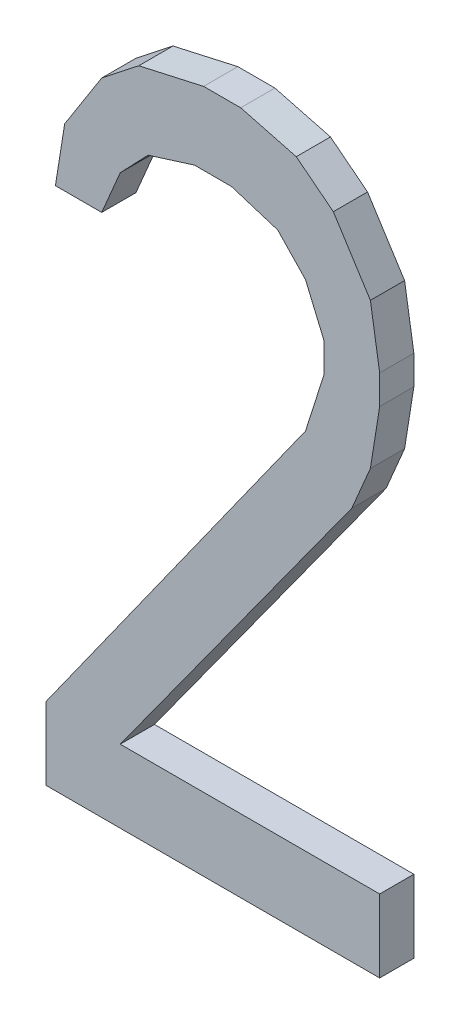
ISO-10303-21;
HEADER;
FILE_DESCRIPTION(('STEP AP214'),'2;1');
FILE_NAME('part.step','',(''),(''),'','','');
FILE_SCHEMA(('AUTOMOTIVE_DESIGN { 1 0 10303 214 1 1 1 1 }'));
ENDSEC;
DATA;
#1=APPLICATION_CONTEXT('core data for automotive mechanical design processes');
#2=APPLICATION_PROTOCOL_DEFINITION('international standard','automotive_design',2000,#1);
#3=PRODUCT_CONTEXT('',#1,'mechanical');
#4=PRODUCT('Part','Part','',(#3));
#5=PRODUCT_RELATED_PRODUCT_CATEGORY('part','',(#4));
#6=PRODUCT_DEFINITION_FORMATION('','',#4);
#7=PRODUCT_DEFINITION_CONTEXT('part definition',#1,'design');
#8=PRODUCT_DEFINITION('design','',#6,#7);
#9=PRODUCT_DEFINITION_SHAPE('','',#8);
#10=(LENGTH_UNIT() NAMED_UNIT(*) SI_UNIT(.MILLI.,.METRE.));
#11=(NAMED_UNIT(*) PLANE_ANGLE_UNIT() SI_UNIT($,.RADIAN.));
#12=(NAMED_UNIT(*) SI_UNIT($,.STERADIAN.) SOLID_ANGLE_UNIT());
#13=UNCERTAINTY_MEASURE_WITH_UNIT(LENGTH_MEASURE(1.E-05),#10,'distance_accuracy_value','');
#14=(GEOMETRIC_REPRESENTATION_CONTEXT(3) GLOBAL_UNCERTAINTY_ASSIGNED_CONTEXT((#13)) GLOBAL_UNIT_ASSIGNED_CONTEXT((#10,
#11,#12)) REPRESENTATION_CONTEXT('',''));
#15=CARTESIAN_POINT('',(0.,0.,0.));
#16=DIRECTION('',(0.,0.,1.));
#17=DIRECTION('',(1.,0.,0.));
#18=AXIS2_PLACEMENT_3D('',#15,#16,#17);
#19=CARTESIAN_POINT('',(53.1044905175803,28.1761107349725,5.9));
#20=DIRECTION('',(0.,0.,1.));
#21=DIRECTION('',(1.,0.,0.));
#22=AXIS2_PLACEMENT_3D('',#19,#20,#21);
#23=PLANE('',#22);
#24=DIRECTION('',(0.580454810387713,0.814292461648617,0.));
#25=VECTOR('',#24,1.);
#26=CARTESIAN_POINT('',(53.8628238250903,29.4527064466825,5.9));
#27=LINE('',#26,#25);
#28=CARTESIAN_POINT('',(53.1044905175815,28.3888766968616,5.9));
#29=VERTEX_POINT('',#28);
#30=CARTESIAN_POINT('',(53.8628238250901,29.4527064466826,5.9));
#31=VERTEX_POINT('',#30);
#32=EDGE_CURVE('E345',#29,#31,#27,.T.);
#33=ORIENTED_EDGE('',*,*,#32,.T.);
#34=DIRECTION('',(0.303244398295526,0.952912816002799,0.));
#35=VECTOR('',#34,1.);
#36=CARTESIAN_POINT('',(53.9169904401004,29.6229191923525,5.9));
#37=LINE('',#36,#35);
#38=CARTESIAN_POINT('',(53.9169904401003,29.622919192352,5.9));
#39=VERTEX_POINT('',#38);
#40=EDGE_CURVE('E340',#31,#39,#37,.T.);
#41=ORIENTED_EDGE('',*,*,#40,.T.);
#42=DIRECTION('',(0.,1.,0.));
#43=VECTOR('',#42,1.);
#44=CARTESIAN_POINT('',(53.9169904401004,29.7080256843925,5.9));
#45=LINE('',#44,#43);
#46=CARTESIAN_POINT('',(53.9169904400999,29.7080256843923,5.9));
#47=VERTEX_POINT('',#46);
#48=EDGE_CURVE('E335',#39,#47,#45,.T.);
#49=ORIENTED_EDGE('',*,*,#48,.T.);
#50=DIRECTION('',(-0.39059882188215,0.920561003054266,0.));
#51=VECTOR('',#50,1.);
#52=CARTESIAN_POINT('',(53.8628238250903,29.8356852436425,5.9));
#53=LINE('',#52,#51);
#54=CARTESIAN_POINT('',(53.8628238250892,29.8356852436411,5.9));
#55=VERTEX_POINT('',#54);
#56=EDGE_CURVE('E330',#47,#55,#53,.T.);
#57=ORIENTED_EDGE('',*,*,#56,.T.);
#58=DIRECTION('',(-0.690529546939537,0.723304185528798,0.));
#59=VECTOR('',#58,1.);
#60=CARTESIAN_POINT('',(53.7815738250904,29.9207916164725,5.9));
#61=LINE('',#60,#59);
#62=CARTESIAN_POINT('',(53.7815738250908,29.9207916164749,5.9));
#63=VERTEX_POINT('',#62);
#64=EDGE_CURVE('E325',#55,#63,#61,.T.);
#65=ORIENTED_EDGE('',*,*,#64,.T.);
#66=DIRECTION('',(-0.954006453759087,0.299786067364732,0.));
#67=VECTOR('',#66,1.);
#68=CARTESIAN_POINT('',(53.6461572100804,29.9633448028925,5.9));
#69=LINE('',#68,#67);
#70=CARTESIAN_POINT('',(53.6461572100826,29.9633448028918,5.9));
#71=VERTEX_POINT('',#70);
#72=EDGE_CURVE('E320',#63,#71,#69,.T.);
#73=ORIENTED_EDGE('',*,*,#72,.T.);
#74=DIRECTION('',(1.,0.,0.));
#75=VECTOR('',#74,1.);
#76=CARTESIAN_POINT('',(53.5378238250904,29.9633448028925,5.9));
#77=LINE('',#76,#75);
#78=CARTESIAN_POINT('',(53.5378238250912,29.9633448028903,5.9));
#79=VERTEX_POINT('',#78);
#80=EDGE_CURVE('E315',#71,#79,#77,.F.);
#81=ORIENTED_EDGE('',*,*,#80,.T.);
#82=DIRECTION('',(-0.954006453759069,-0.299786067364788,0.));
#83=VECTOR('',#82,1.);
#84=CARTESIAN_POINT('',(53.4024072100803,29.9207916164725,5.9));
#85=LINE('',#84,#83);
#86=CARTESIAN_POINT('',(53.4024072100789,29.9207916164736,5.9));
#87=VERTEX_POINT('',#86);
#88=EDGE_CURVE('E310',#79,#87,#85,.T.);
#89=ORIENTED_EDGE('',*,*,#88,.T.);
#90=DIRECTION('',(-0.690529546939631,-0.723304185528709,0.));
#91=VECTOR('',#90,1.);
#92=CARTESIAN_POINT('',(53.3211572100803,29.8356852436425,5.9));
#93=LINE('',#92,#91);
#94=CARTESIAN_POINT('',(53.3211572100814,29.8356852436422,5.9));
#95=VERTEX_POINT('',#94);
#96=EDGE_CURVE('E305',#87,#95,#93,.T.);
#97=ORIENTED_EDGE('',*,*,#96,.T.);
#98=DIRECTION('',(-0.390599768898726,-0.920560601229632,0.));
#99=VECTOR('',#98,1.);
#100=CARTESIAN_POINT('',(53.2669904401004,29.7080256843925,5.9));
#101=LINE('',#100,#99);
#102=CARTESIAN_POINT('',(53.2669904401005,29.7080256843927,5.9));
#103=VERTEX_POINT('',#102);
#104=EDGE_CURVE('E300',#95,#103,#101,.T.);
#105=ORIENTED_EDGE('',*,*,#104,.T.);
#106=DIRECTION('',(1.,0.,0.));
#107=VECTOR('',#106,1.);
#108=CARTESIAN_POINT('',(53.1315738250904,29.7080256843925,5.9));
#109=LINE('',#108,#107);
#110=CARTESIAN_POINT('',(53.1315738250853,29.7080256843931,5.9));
#111=VERTEX_POINT('',#110);
#112=EDGE_CURVE('E295',#103,#111,#109,.F.);
#113=ORIENTED_EDGE('',*,*,#112,.T.);
#114=DIRECTION('',(0.15713772379296,0.987576698672649,0.));
#115=VECTOR('',#114,1.);
#116=CARTESIAN_POINT('',(53.1586571325904,29.8782384300625,5.9));
#117=LINE('',#116,#115);
#118=CARTESIAN_POINT('',(53.1586571325953,29.8782384300585,5.9));
#119=VERTEX_POINT('',#118);
#120=EDGE_CURVE('E290',#111,#119,#117,.T.);
#121=ORIENTED_EDGE('',*,*,#120,.T.);
#122=DIRECTION('',(0.536932307419045,0.84362532990046,0.));
#123=VECTOR('',#122,1.);
#124=CARTESIAN_POINT('',(53.2669904401004,30.0484511757225,5.9));
#125=LINE('',#124,#123);
#126=CARTESIAN_POINT('',(53.266990440098,30.0484511757263,5.9));
#127=VERTEX_POINT('',#126);
#128=EDGE_CURVE('E285',#119,#127,#125,.T.);
#129=ORIENTED_EDGE('',*,*,#128,.T.);
#130=DIRECTION('',(0.786363175289572,0.61776448307466,0.));
#131=VECTOR('',#130,1.);
#132=CARTESIAN_POINT('',(53.3753238250904,30.1335575485625,5.9));
#133=LINE('',#132,#131);
#134=CARTESIAN_POINT('',(53.3753238250908,30.1335575485575,5.9));
#135=VERTEX_POINT('',#134);
#136=EDGE_CURVE('E280',#127,#135,#133,.T.);
#137=ORIENTED_EDGE('',*,*,#136,.T.);
#138=DIRECTION('',(0.975723235122169,0.219007233768041,0.));
#139=VECTOR('',#138,1.);
#140=CARTESIAN_POINT('',(53.5649072100804,30.1761107349725,5.9));
#141=LINE('',#140,#139);
#142=CARTESIAN_POINT('',(53.5649072100873,30.176110734974,5.9));
#143=VERTEX_POINT('',#142);
#144=EDGE_CURVE('E275',#135,#143,#141,.T.);
#145=ORIENTED_EDGE('',*,*,#144,.T.);
#146=DIRECTION('',(1.,0.,0.));
#147=VECTOR('',#146,1.);
#148=CARTESIAN_POINT('',(53.6732404401004,30.1761107349725,5.9));
#149=LINE('',#148,#147);
#150=CARTESIAN_POINT('',(53.673240440102,30.1761107349772,5.9));
#151=VERTEX_POINT('',#150);
#152=EDGE_CURVE('E270',#143,#151,#149,.T.);
#153=ORIENTED_EDGE('',*,*,#152,.T.);
#154=DIRECTION('',(0.9673814694122,-0.253324086177948,0.));
#155=VECTOR('',#154,1.);
#156=CARTESIAN_POINT('',(53.8357404401003,30.1335575485625,5.9));
#157=LINE('',#156,#155);
#158=CARTESIAN_POINT('',(53.8357404400971,30.1335575485593,5.9));
#159=VERTEX_POINT('',#158);
#160=EDGE_CURVE('E265',#151,#159,#157,.T.);
#161=ORIENTED_EDGE('',*,*,#160,.T.);
#162=DIRECTION('',(0.786363175289397,-0.617764483074882,0.));
#163=VECTOR('',#162,1.);
#164=CARTESIAN_POINT('',(53.9440738250904,30.0484511757225,5.9));
#165=LINE('',#164,#163);
#166=CARTESIAN_POINT('',(53.9440738250924,30.0484511757236,5.9));
#167=VERTEX_POINT('',#166);
#168=EDGE_CURVE('E260',#159,#167,#165,.T.);
#169=ORIENTED_EDGE('',*,*,#168,.T.);
#170=DIRECTION('',(0.536932580744469,-0.843625155940175,0.));
#171=VECTOR('',#170,1.);
#172=CARTESIAN_POINT('',(54.0524072100804,29.8782384300625,5.9));
#173=LINE('',#172,#171);
#174=CARTESIAN_POINT('',(54.052407210081,29.8782384300625,5.9));
#175=VERTEX_POINT('',#174);
#176=EDGE_CURVE('E255',#167,#175,#173,.T.);
#177=ORIENTED_EDGE('',*,*,#176,.T.);
#178=DIRECTION('',(0.157137285318935,-0.987576768440102,0.));
#179=VECTOR('',#178,1.);
#180=CARTESIAN_POINT('',(54.0794904401004,29.7080256843925,5.9));
#181=LINE('',#180,#179);
#182=CARTESIAN_POINT('',(54.0794904401002,29.7080256843939,5.9));
#183=VERTEX_POINT('',#182);
#184=EDGE_CURVE('E250',#175,#183,#181,.T.);
#185=ORIENTED_EDGE('',*,*,#184,.T.);
#186=DIRECTION('',(0.,1.,0.));
#187=VECTOR('',#186,1.);
#188=CARTESIAN_POINT('',(54.0794904401004,29.6229191923525,5.9));
#189=LINE('',#188,#187);
#190=CARTESIAN_POINT('',(54.0794904400998,29.6229191923526,5.9));
#191=VERTEX_POINT('',#190);
#192=EDGE_CURVE('E245',#183,#191,#189,.F.);
#193=ORIENTED_EDGE('',*,*,#192,.T.);
#194=DIRECTION('',(-0.157137285318733,-0.987576768440135,0.));
#195=VECTOR('',#194,1.);
#196=CARTESIAN_POINT('',(54.0524072100804,29.4527064466825,5.9));
#197=LINE('',#196,#195);
#198=CARTESIAN_POINT('',(54.0524072100813,29.4527064466821,5.9));
#199=VERTEX_POINT('',#198);
#200=EDGE_CURVE('E240',#191,#199,#197,.T.);
#201=ORIENTED_EDGE('',*,*,#200,.T.);
#202=DIRECTION('',(-0.390599768898726,-0.920560601229632,0.));
#203=VECTOR('',#202,1.);
#204=CARTESIAN_POINT('',(53.9982404401003,29.3250468874325,5.9));
#205=LINE('',#204,#203);
#206=CARTESIAN_POINT('',(53.9982404400988,29.3250468874339,5.9));
#207=VERTEX_POINT('',#206);
#208=EDGE_CURVE('E235',#199,#207,#205,.T.);
#209=ORIENTED_EDGE('',*,*,#208,.T.);
#210=DIRECTION('',(-0.58603667459112,-0.810284527825987,0.));
#211=VECTOR('',#210,1.);
#212=CARTESIAN_POINT('',(53.3211572100803,28.3888766968625,5.9));
#213=LINE('',#212,#211);
#214=CARTESIAN_POINT('',(53.3211572100803,28.3888766968625,5.9));
#215=VERTEX_POINT('',#214);
#216=EDGE_CURVE('E230',#207,#215,#213,.T.);
#217=ORIENTED_EDGE('',*,*,#216,.T.);
#218=DIRECTION('',(1.,0.,0.));
#219=VECTOR('',#218,1.);
#220=CARTESIAN_POINT('',(54.0794904401003,28.3888766968625,5.9));
#221=LINE('',#220,#219);
#222=CARTESIAN_POINT('',(54.0794904401003,28.3888766968625,5.9));
#223=VERTEX_POINT('',#222);
#224=EDGE_CURVE('E226',#215,#223,#221,.T.);
#225=ORIENTED_EDGE('',*,*,#224,.T.);
#226=DIRECTION('',(0.,1.,0.));
#227=VECTOR('',#226,1.);
#228=CARTESIAN_POINT('',(54.0794904401003,28.1761107349725,5.9));
#229=LINE('',#228,#227);
#230=CARTESIAN_POINT('',(54.0794904401003,28.1761107349725,5.9));
#231=VERTEX_POINT('',#230);
#232=EDGE_CURVE('E213',#223,#231,#229,.F.);
#233=ORIENTED_EDGE('',*,*,#232,.T.);
#234=DIRECTION('',(1.,0.,0.));
#235=VECTOR('',#234,1.);
#236=CARTESIAN_POINT('',(53.1044905175803,28.1761107349725,5.9));
#237=LINE('',#236,#235);
#238=CARTESIAN_POINT('',(53.1044905175803,28.1761107349725,5.9));
#239=VERTEX_POINT('',#238);
#240=EDGE_CURVE('E199',#231,#239,#237,.F.);
#241=ORIENTED_EDGE('',*,*,#240,.T.);
#242=DIRECTION('',(0.,1.,0.));
#243=VECTOR('',#242,1.);
#244=CARTESIAN_POINT('',(53.1044905175803,28.3888766968625,5.9));
#245=LINE('',#244,#243);
#246=EDGE_CURVE('E20',#239,#29,#245,.T.);
#247=ORIENTED_EDGE('',*,*,#246,.T.);
#248=EDGE_LOOP('',(#33,#41,#49,#57,#65,#73,#81,#89,#97,#105,#113,#121,#129,#137,#145,#153,#161,
#169,#177,#185,#193,#201,#209,#217,#225,#233,#241,#247));
#249=FACE_BOUND('',#248,.T.);
#250=ADVANCED_FACE('F17',(#249),#23,.F.);
#251=CARTESIAN_POINT('',(53.1044905175803,28.3888766968625,6.));
#252=DIRECTION('',(1.,0.,0.));
#253=DIRECTION('',(0.,0.,-1.));
#254=AXIS2_PLACEMENT_3D('',#251,#252,#253);
#255=PLANE('',#254);
#256=DIRECTION('',(0.,0.,1.));
#257=VECTOR('',#256,1.);
#258=CARTESIAN_POINT('',(53.1044905175803,28.1761107349725,6.));
#259=LINE('',#258,#257);
#260=CARTESIAN_POINT('',(53.1044905175803,28.1761107349725,6.));
#261=VERTEX_POINT('',#260);
#262=EDGE_CURVE('E205',#239,#261,#259,.T.);
#263=ORIENTED_EDGE('',*,*,#262,.T.);
#264=DIRECTION('',(0.,1.,0.));
#265=VECTOR('',#264,1.);
#266=CARTESIAN_POINT('',(53.1044905175803,28.1761107349725,6.));
#267=LINE('',#266,#265);
#268=CARTESIAN_POINT('',(53.1044905175815,28.3888766968616,6.));
#269=VERTEX_POINT('',#268);
#270=EDGE_CURVE('E347',#269,#261,#267,.F.);
#271=ORIENTED_EDGE('',*,*,#270,.F.);
#272=DIRECTION('',(0.,0.,1.));
#273=VECTOR('',#272,1.);
#274=CARTESIAN_POINT('',(53.1044905175851,28.3888766968591,6.));
#275=LINE('',#274,#273);
#276=EDGE_CURVE('E208',#269,#29,#275,.F.);
#277=ORIENTED_EDGE('',*,*,#276,.T.);
#278=ORIENTED_EDGE('',*,*,#246,.F.);
#279=EDGE_LOOP('',(#263,#271,#277,#278));
#280=FACE_BOUND('',#279,.T.);
#281=ADVANCED_FACE('F204',(#280),#255,.F.);
#282=CARTESIAN_POINT('',(53.1044905175803,28.1761107349725,6.));
#283=DIRECTION('',(0.,1.,0.));
#284=DIRECTION('',(0.,0.,1.));
#285=AXIS2_PLACEMENT_3D('',#282,#283,#284);
#286=PLANE('',#285);
#287=DIRECTION('',(0.,0.,1.));
#288=VECTOR('',#287,1.);
#289=CARTESIAN_POINT('',(54.0794904401003,28.1761107349725,6.));
#290=LINE('',#289,#288);
#291=CARTESIAN_POINT('',(54.0794904401003,28.1761107349725,6.));
#292=VERTEX_POINT('',#291);
#293=EDGE_CURVE('E215',#231,#292,#290,.T.);
#294=ORIENTED_EDGE('',*,*,#293,.T.);
#295=DIRECTION('',(1.,0.,0.));
#296=VECTOR('',#295,1.);
#297=CARTESIAN_POINT('',(53.1044905175803,28.1761107349725,6.));
#298=LINE('',#297,#296);
#299=EDGE_CURVE('E219',#261,#292,#298,.T.);
#300=ORIENTED_EDGE('',*,*,#299,.F.);
#301=ORIENTED_EDGE('',*,*,#262,.F.);
#302=ORIENTED_EDGE('',*,*,#240,.F.);
#303=EDGE_LOOP('',(#294,#300,#301,#302));
#304=FACE_BOUND('',#303,.T.);
#305=ADVANCED_FACE('F217',(#304),#286,.F.);
#306=CARTESIAN_POINT('',(54.0794904401003,28.1761107349725,6.));
#307=DIRECTION('',(-1.,0.,0.));
#308=DIRECTION('',(0.,0.,1.));
#309=AXIS2_PLACEMENT_3D('',#306,#307,#308);
#310=PLANE('',#309);
#311=DIRECTION('',(0.,0.,-1.));
#312=VECTOR('',#311,1.);
#313=CARTESIAN_POINT('',(54.0794904401003,28.3888766968625,6.));
#314=LINE('',#313,#312);
#315=CARTESIAN_POINT('',(54.0794904401003,28.3888766968625,6.));
#316=VERTEX_POINT('',#315);
#317=EDGE_CURVE('E224',#223,#316,#314,.F.);
#318=ORIENTED_EDGE('',*,*,#317,.T.);
#319=DIRECTION('',(0.,1.,0.));
#320=VECTOR('',#319,1.);
#321=CARTESIAN_POINT('',(54.0794904401003,28.1761107349725,6.));
#322=LINE('',#321,#320);
#323=EDGE_CURVE('E350',#292,#316,#322,.T.);
#324=ORIENTED_EDGE('',*,*,#323,.F.);
#325=ORIENTED_EDGE('',*,*,#293,.F.);
#326=ORIENTED_EDGE('',*,*,#232,.F.);
#327=EDGE_LOOP('',(#318,#324,#325,#326));
#328=FACE_BOUND('',#327,.T.);
#329=ADVANCED_FACE('F532',(#328),#310,.F.);
#330=CARTESIAN_POINT('',(54.0794904401003,28.3888766968625,6.));
#331=DIRECTION('',(0.,-1.,0.));
#332=DIRECTION('',(0.,0.,-1.));
#333=AXIS2_PLACEMENT_3D('',#330,#331,#332);
#334=PLANE('',#333);
#335=DIRECTION('',(0.,0.,1.));
#336=VECTOR('',#335,1.);
#337=CARTESIAN_POINT('',(53.3211572100803,28.3888766968625,6.));
#338=LINE('',#337,#336);
#339=CARTESIAN_POINT('',(53.3211572100803,28.3888766968625,6.));
#340=VERTEX_POINT('',#339);
#341=EDGE_CURVE('E228',#215,#340,#338,.T.);
#342=ORIENTED_EDGE('',*,*,#341,.T.);
#343=DIRECTION('',(1.,0.,0.));
#344=VECTOR('',#343,1.);
#345=CARTESIAN_POINT('',(53.1044905175803,28.3888766968625,6.));
#346=LINE('',#345,#344);
#347=EDGE_CURVE('E353',#316,#340,#346,.F.);
#348=ORIENTED_EDGE('',*,*,#347,.F.);
#349=ORIENTED_EDGE('',*,*,#317,.F.);
#350=ORIENTED_EDGE('',*,*,#224,.F.);
#351=EDGE_LOOP('',(#342,#348,#349,#350));
#352=FACE_BOUND('',#351,.T.);
#353=ADVANCED_FACE('F528',(#352),#334,.F.);
#354=CARTESIAN_POINT('',(53.3211572100803,28.3888766968625,6.));
#355=DIRECTION('',(-0.810284527825987,0.58603667459112,0.));
#356=DIRECTION('',(-0.58603667459112,-0.810284527825987,0.));
#357=AXIS2_PLACEMENT_3D('',#354,#355,#356);
#358=PLANE('',#357);
#359=DIRECTION('',(0.,0.,1.));
#360=VECTOR('',#359,1.);
#361=CARTESIAN_POINT('',(53.9982404401006,29.3250468874331,6.));
#362=LINE('',#361,#360);
#363=CARTESIAN_POINT('',(53.9982404400988,29.3250468874339,6.));
#364=VERTEX_POINT('',#363);
#365=EDGE_CURVE('E233',#207,#364,#362,.T.);
#366=ORIENTED_EDGE('',*,*,#365,.T.);
#367=DIRECTION('',(0.586036674591144,0.810284527825969,0.));
#368=VECTOR('',#367,1.);
#369=CARTESIAN_POINT('',(53.3211572100803,28.3888766968625,6.));
#370=LINE('',#369,#368);
#371=EDGE_CURVE('E356',#340,#364,#370,.T.);
#372=ORIENTED_EDGE('',*,*,#371,.F.);
#373=ORIENTED_EDGE('',*,*,#341,.F.);
#374=ORIENTED_EDGE('',*,*,#216,.F.);
#375=EDGE_LOOP('',(#366,#372,#373,#374));
#376=FACE_BOUND('',#375,.T.);
#377=ADVANCED_FACE('F524',(#376),#358,.F.);
#378=CARTESIAN_POINT('',(53.9982404401003,29.3250468874325,6.));
#379=DIRECTION('',(-0.920560601229632,0.390599768898726,0.));
#380=DIRECTION('',(-0.390599768898726,-0.920560601229632,0.));
#381=AXIS2_PLACEMENT_3D('',#378,#379,#380);
#382=PLANE('',#381);
#383=DIRECTION('',(0.,0.,1.));
#384=VECTOR('',#383,1.);
#385=CARTESIAN_POINT('',(54.0524072100804,29.4527064466822,6.));
#386=LINE('',#385,#384);
#387=CARTESIAN_POINT('',(54.0524072100813,29.4527064466821,6.));
#388=VERTEX_POINT('',#387);
#389=EDGE_CURVE('E238',#199,#388,#386,.T.);
#390=ORIENTED_EDGE('',*,*,#389,.T.);
#391=DIRECTION('',(0.390599768916248,0.920560601222198,0.));
#392=VECTOR('',#391,1.);
#393=CARTESIAN_POINT('',(53.9982404400982,29.3250468874341,6.));
#394=LINE('',#393,#392);
#395=EDGE_CURVE('E359',#364,#388,#394,.T.);
#396=ORIENTED_EDGE('',*,*,#395,.F.);
#397=ORIENTED_EDGE('',*,*,#365,.F.);
#398=ORIENTED_EDGE('',*,*,#208,.F.);
#399=EDGE_LOOP('',(#390,#396,#397,#398));
#400=FACE_BOUND('',#399,.T.);
#401=ADVANCED_FACE('F520',(#400),#382,.F.);
#402=CARTESIAN_POINT('',(54.0524072100804,29.4527064466825,6.));
#403=DIRECTION('',(-0.987576768440135,0.157137285318733,0.));
#404=DIRECTION('',(-0.157137285318733,-0.987576768440135,0.));
#405=AXIS2_PLACEMENT_3D('',#402,#403,#404);
#406=PLANE('',#405);
#407=DIRECTION('',(0.,0.,1.));
#408=VECTOR('',#407,1.);
#409=CARTESIAN_POINT('',(54.0794904401004,29.6229191923526,6.));
#410=LINE('',#409,#408);
#411=CARTESIAN_POINT('',(54.0794904400998,29.6229191923526,6.));
#412=VERTEX_POINT('',#411);
#413=EDGE_CURVE('E243',#191,#412,#410,.T.);
#414=ORIENTED_EDGE('',*,*,#413,.T.);
#415=DIRECTION('',(0.157137285311119,0.987576768441346,0.));
#416=VECTOR('',#415,1.);
#417=CARTESIAN_POINT('',(54.0524072100816,29.452706446682,6.));
#418=LINE('',#417,#416);
#419=EDGE_CURVE('E362',#388,#412,#418,.T.);
#420=ORIENTED_EDGE('',*,*,#419,.F.);
#421=ORIENTED_EDGE('',*,*,#389,.F.);
#422=ORIENTED_EDGE('',*,*,#200,.F.);
#423=EDGE_LOOP('',(#414,#420,#421,#422));
#424=FACE_BOUND('',#423,.T.);
#425=ADVANCED_FACE('F516',(#424),#406,.F.);
#426=CARTESIAN_POINT('',(54.0794904401004,29.6229191923525,6.));
#427=DIRECTION('',(-1.,0.,0.));
#428=DIRECTION('',(0.,0.,1.));
#429=AXIS2_PLACEMENT_3D('',#426,#427,#428);
#430=PLANE('',#429);
#431=DIRECTION('',(0.,0.,1.));
#432=VECTOR('',#431,1.);
#433=CARTESIAN_POINT('',(54.0794904401004,29.7080256843925,6.));
#434=LINE('',#433,#432);
#435=CARTESIAN_POINT('',(54.0794904401002,29.7080256843939,6.));
#436=VERTEX_POINT('',#435);
#437=EDGE_CURVE('E248',#183,#436,#434,.T.);
#438=ORIENTED_EDGE('',*,*,#437,.T.);
#439=DIRECTION('',(0.,1.,0.));
#440=VECTOR('',#439,1.);
#441=CARTESIAN_POINT('',(54.0794904400995,28.1761107349725,6.));
#442=LINE('',#441,#440);
#443=EDGE_CURVE('E365',#412,#436,#442,.T.);
#444=ORIENTED_EDGE('',*,*,#443,.F.);
#445=ORIENTED_EDGE('',*,*,#413,.F.);
#446=ORIENTED_EDGE('',*,*,#192,.F.);
#447=EDGE_LOOP('',(#438,#444,#445,#446));
#448=FACE_BOUND('',#447,.T.);
#449=ADVANCED_FACE('F512',(#448),#430,.F.);
#450=CARTESIAN_POINT('',(54.0794904401004,29.7080256843925,6.));
#451=DIRECTION('',(-0.987576768440102,-0.157137285318935,0.));
#452=DIRECTION('',(0.157137285318935,-0.987576768440102,0.));
#453=AXIS2_PLACEMENT_3D('',#450,#451,#452);
#454=PLANE('',#453);
#455=DIRECTION('',(0.,0.,1.));
#456=VECTOR('',#455,1.);
#457=CARTESIAN_POINT('',(54.0524072100806,29.8782384300622,6.));
#458=LINE('',#457,#456);
#459=CARTESIAN_POINT('',(54.052407210081,29.8782384300625,6.));
#460=VERTEX_POINT('',#459);
#461=EDGE_CURVE('E253',#175,#460,#458,.T.);
#462=ORIENTED_EDGE('',*,*,#461,.T.);
#463=DIRECTION('',(-0.157137285318948,0.9875767684401,0.));
#464=VECTOR('',#463,1.);
#465=CARTESIAN_POINT('',(54.0794904401004,29.7080256843925,6.));
#466=LINE('',#465,#464);
#467=EDGE_CURVE('E368',#436,#460,#466,.T.);
#468=ORIENTED_EDGE('',*,*,#467,.F.);
#469=ORIENTED_EDGE('',*,*,#437,.F.);
#470=ORIENTED_EDGE('',*,*,#184,.F.);
#471=EDGE_LOOP('',(#462,#468,#469,#470));
#472=FACE_BOUND('',#471,.T.);
#473=ADVANCED_FACE('F508',(#472),#454,.F.);
#474=CARTESIAN_POINT('',(54.0524072100804,29.8782384300625,6.));
#475=DIRECTION('',(-0.843625155940175,-0.536932580744469,0.));
#476=DIRECTION('',(0.536932580744469,-0.843625155940175,0.));
#477=AXIS2_PLACEMENT_3D('',#474,#475,#476);
#478=PLANE('',#477);
#479=DIRECTION('',(0.,0.,1.));
#480=VECTOR('',#479,1.);
#481=CARTESIAN_POINT('',(53.9440738250911,30.0484511757219,6.));
#482=LINE('',#481,#480);
#483=CARTESIAN_POINT('',(53.9440738250924,30.0484511757236,6.));
#484=VERTEX_POINT('',#483);
#485=EDGE_CURVE('E258',#167,#484,#482,.T.);
#486=ORIENTED_EDGE('',*,*,#485,.T.);
#487=DIRECTION('',(-0.536932580747523,0.843625155938231,0.));
#488=VECTOR('',#487,1.);
#489=CARTESIAN_POINT('',(54.0524072100812,29.8782384300626,6.));
#490=LINE('',#489,#488);
#491=EDGE_CURVE('E371',#460,#484,#490,.T.);
#492=ORIENTED_EDGE('',*,*,#491,.F.);
#493=ORIENTED_EDGE('',*,*,#461,.F.);
#494=ORIENTED_EDGE('',*,*,#176,.F.);
#495=EDGE_LOOP('',(#486,#492,#493,#494));
#496=FACE_BOUND('',#495,.T.);
#497=ADVANCED_FACE('F504',(#496),#478,.F.);
#498=CARTESIAN_POINT('',(53.9440738250904,30.0484511757225,6.));
#499=DIRECTION('',(-0.617764483074882,-0.786363175289397,0.));
#500=DIRECTION('',(0.786363175289397,-0.617764483074882,0.));
#501=AXIS2_PLACEMENT_3D('',#498,#499,#500);
#502=PLANE('',#501);
#503=DIRECTION('',(0.,0.,1.));
#504=VECTOR('',#503,1.);
#505=CARTESIAN_POINT('',(53.8357404400981,30.1335575485631,6.));
#506=LINE('',#505,#504);
#507=CARTESIAN_POINT('',(53.8357404400971,30.1335575485593,6.));
#508=VERTEX_POINT('',#507);
#509=EDGE_CURVE('E263',#159,#508,#506,.T.);
#510=ORIENTED_EDGE('',*,*,#509,.T.);
#511=DIRECTION('',(-0.786363175301868,0.617764483059008,0.));
#512=VECTOR('',#511,1.);
#513=CARTESIAN_POINT('',(53.9440738250928,30.0484511757241,6.));
#514=LINE('',#513,#512);
#515=EDGE_CURVE('E374',#484,#508,#514,.T.);
#516=ORIENTED_EDGE('',*,*,#515,.F.);
#517=ORIENTED_EDGE('',*,*,#485,.F.);
#518=ORIENTED_EDGE('',*,*,#168,.F.);
#519=EDGE_LOOP('',(#510,#516,#517,#518));
#520=FACE_BOUND('',#519,.T.);
#521=ADVANCED_FACE('F500',(#520),#502,.F.);
#522=CARTESIAN_POINT('',(53.8357404401003,30.1335575485625,6.));
#523=DIRECTION('',(-0.253324086177948,-0.9673814694122,0.));
#524=DIRECTION('',(0.9673814694122,-0.253324086177948,0.));
#525=AXIS2_PLACEMENT_3D('',#522,#523,#524);
#526=PLANE('',#525);
#527=DIRECTION('',(0.,0.,-1.));
#528=VECTOR('',#527,1.);
#529=CARTESIAN_POINT('',(53.673240440102,30.1761107349725,6.));
#530=LINE('',#529,#528);
#531=CARTESIAN_POINT('',(53.673240440102,30.1761107349772,6.));
#532=VERTEX_POINT('',#531);
#533=EDGE_CURVE('E268',#151,#532,#530,.F.);
#534=ORIENTED_EDGE('',*,*,#533,.T.);
#535=DIRECTION('',(-0.967381469404306,0.253324086208095,0.));
#536=VECTOR('',#535,1.);
#537=CARTESIAN_POINT('',(53.8357404400968,30.133557548558,6.));
#538=LINE('',#537,#536);
#539=EDGE_CURVE('E377',#508,#532,#538,.T.);
#540=ORIENTED_EDGE('',*,*,#539,.F.);
#541=ORIENTED_EDGE('',*,*,#509,.F.);
#542=ORIENTED_EDGE('',*,*,#160,.F.);
#543=EDGE_LOOP('',(#534,#540,#541,#542));
#544=FACE_BOUND('',#543,.T.);
#545=ADVANCED_FACE('F496',(#544),#526,.F.);
#546=CARTESIAN_POINT('',(53.6732404401004,30.1761107349725,6.));
#547=DIRECTION('',(0.,-1.,0.));
#548=DIRECTION('',(0.,0.,-1.));
#549=AXIS2_PLACEMENT_3D('',#546,#547,#548);
#550=PLANE('',#549);
#551=DIRECTION('',(0.,0.,1.));
#552=VECTOR('',#551,1.);
#553=CARTESIAN_POINT('',(53.5649072100804,30.1761107349725,6.));
#554=LINE('',#553,#552);
#555=CARTESIAN_POINT('',(53.5649072100873,30.176110734974,6.));
#556=VERTEX_POINT('',#555);
#557=EDGE_CURVE('E273',#143,#556,#554,.T.);
#558=ORIENTED_EDGE('',*,*,#557,.T.);
#559=DIRECTION('',(1.,0.,0.));
#560=VECTOR('',#559,1.);
#561=CARTESIAN_POINT('',(53.1044905175803,30.1761107349787,6.));
#562=LINE('',#561,#560);
#563=EDGE_CURVE('E380',#532,#556,#562,.F.);
#564=ORIENTED_EDGE('',*,*,#563,.F.);
#565=ORIENTED_EDGE('',*,*,#533,.F.);
#566=ORIENTED_EDGE('',*,*,#152,.F.);
#567=EDGE_LOOP('',(#558,#564,#565,#566));
#568=FACE_BOUND('',#567,.T.);
#569=ADVANCED_FACE('F492',(#568),#550,.F.);
#570=CARTESIAN_POINT('',(53.5649072100804,30.1761107349725,6.));
#571=DIRECTION('',(0.219007233768041,-0.975723235122169,0.));
#572=DIRECTION('',(0.975723235122169,0.219007233768041,0.));
#573=AXIS2_PLACEMENT_3D('',#570,#571,#572);
#574=PLANE('',#573);
#575=DIRECTION('',(0.,0.,1.));
#576=VECTOR('',#575,1.);
#577=CARTESIAN_POINT('',(53.3753238250882,30.1335575485608,6.));
#578=LINE('',#577,#576);
#579=CARTESIAN_POINT('',(53.3753238250908,30.1335575485575,6.));
#580=VERTEX_POINT('',#579);
#581=EDGE_CURVE('E278',#135,#580,#578,.T.);
#582=ORIENTED_EDGE('',*,*,#581,.T.);
#583=DIRECTION('',(-0.97572323512226,-0.219007233767634,0.));
#584=VECTOR('',#583,1.);
#585=CARTESIAN_POINT('',(53.5649072100804,30.1761107349725,6.));
#586=LINE('',#585,#584);
#587=EDGE_CURVE('E383',#556,#580,#586,.T.);
#588=ORIENTED_EDGE('',*,*,#587,.F.);
#589=ORIENTED_EDGE('',*,*,#557,.F.);
#590=ORIENTED_EDGE('',*,*,#144,.F.);
#591=EDGE_LOOP('',(#582,#588,#589,#590));
#592=FACE_BOUND('',#591,.T.);
#593=ADVANCED_FACE('F488',(#592),#574,.F.);
#594=CARTESIAN_POINT('',(53.3753238250904,30.1335575485625,6.));
#595=DIRECTION('',(0.61776448307466,-0.786363175289572,0.));
#596=DIRECTION('',(0.786363175289572,0.61776448307466,0.));
#597=AXIS2_PLACEMENT_3D('',#594,#595,#596);
#598=PLANE('',#597);
#599=DIRECTION('',(0.,0.,1.));
#600=VECTOR('',#599,1.);
#601=CARTESIAN_POINT('',(53.2669904401014,30.0484511757241,6.));
#602=LINE('',#601,#600);
#603=CARTESIAN_POINT('',(53.266990440098,30.0484511757263,6.));
#604=VERTEX_POINT('',#603);
#605=EDGE_CURVE('E283',#127,#604,#602,.T.);
#606=ORIENTED_EDGE('',*,*,#605,.T.);
#607=DIRECTION('',(-0.786363175314667,-0.617764483042716,0.));
#608=VECTOR('',#607,1.);
#609=CARTESIAN_POINT('',(53.3753238250917,30.1335575485564,6.));
#610=LINE('',#609,#608);
#611=EDGE_CURVE('E386',#580,#604,#610,.T.);
#612=ORIENTED_EDGE('',*,*,#611,.F.);
#613=ORIENTED_EDGE('',*,*,#581,.F.);
#614=ORIENTED_EDGE('',*,*,#136,.F.);
#615=EDGE_LOOP('',(#606,#612,#613,#614));
#616=FACE_BOUND('',#615,.T.);
#617=ADVANCED_FACE('F484',(#616),#598,.F.);
#618=CARTESIAN_POINT('',(53.2669904401004,30.0484511757225,6.));
#619=DIRECTION('',(0.84362532990046,-0.536932307419045,0.));
#620=DIRECTION('',(0.536932307419045,0.84362532990046,0.));
#621=AXIS2_PLACEMENT_3D('',#618,#619,#620);
#622=PLANE('',#621);
#623=DIRECTION('',(0.,0.,1.));
#624=VECTOR('',#623,1.);
#625=CARTESIAN_POINT('',(53.1586571325899,29.8782384300593,6.));
#626=LINE('',#625,#624);
#627=CARTESIAN_POINT('',(53.1586571325953,29.8782384300585,6.));
#628=VERTEX_POINT('',#627);
#629=EDGE_CURVE('E288',#119,#628,#626,.T.);
#630=ORIENTED_EDGE('',*,*,#629,.T.);
#631=DIRECTION('',(-0.536932307396321,-0.843625329914923,0.));
#632=VECTOR('',#631,1.);
#633=CARTESIAN_POINT('',(53.2669904400968,30.048451175727,6.));
#634=LINE('',#633,#632);
#635=EDGE_CURVE('E389',#604,#628,#634,.T.);
#636=ORIENTED_EDGE('',*,*,#635,.F.);
#637=ORIENTED_EDGE('',*,*,#605,.F.);
#638=ORIENTED_EDGE('',*,*,#128,.F.);
#639=EDGE_LOOP('',(#630,#636,#637,#638));
#640=FACE_BOUND('',#639,.T.);
#641=ADVANCED_FACE('F480',(#640),#622,.F.);
#642=CARTESIAN_POINT('',(53.1586571325904,29.8782384300625,6.));
#643=DIRECTION('',(0.987576698672649,-0.15713772379296,0.));
#644=DIRECTION('',(0.15713772379296,0.987576698672649,0.));
#645=AXIS2_PLACEMENT_3D('',#642,#643,#644);
#646=PLANE('',#645);
#647=DIRECTION('',(0.,0.,1.));
#648=VECTOR('',#647,1.);
#649=CARTESIAN_POINT('',(53.1315738250853,29.7080256843925,6.));
#650=LINE('',#649,#648);
#651=CARTESIAN_POINT('',(53.1315738250853,29.7080256843931,6.));
#652=VERTEX_POINT('',#651);
#653=EDGE_CURVE('E293',#111,#652,#650,.T.);
#654=ORIENTED_EDGE('',*,*,#653,.T.);
#655=DIRECTION('',(-0.157137723834817,-0.987576698665988,0.));
#656=VECTOR('',#655,1.);
#657=CARTESIAN_POINT('',(53.1586571325971,29.8782384300582,6.));
#658=LINE('',#657,#656);
#659=EDGE_CURVE('E392',#628,#652,#658,.T.);
#660=ORIENTED_EDGE('',*,*,#659,.F.);
#661=ORIENTED_EDGE('',*,*,#629,.F.);
#662=ORIENTED_EDGE('',*,*,#120,.F.);
#663=EDGE_LOOP('',(#654,#660,#661,#662));
#664=FACE_BOUND('',#663,.T.);
#665=ADVANCED_FACE('F476',(#664),#646,.F.);
#666=CARTESIAN_POINT('',(53.1315738250904,29.7080256843925,6.));
#667=DIRECTION('',(0.,1.,0.));
#668=DIRECTION('',(0.,0.,1.));
#669=AXIS2_PLACEMENT_3D('',#666,#667,#668);
#670=PLANE('',#669);
#671=DIRECTION('',(0.,0.,1.));
#672=VECTOR('',#671,1.);
#673=CARTESIAN_POINT('',(53.2669904401004,29.7080256843925,6.));
#674=LINE('',#673,#672);
#675=CARTESIAN_POINT('',(53.2669904401005,29.7080256843927,6.));
#676=VERTEX_POINT('',#675);
#677=EDGE_CURVE('E298',#103,#676,#674,.T.);
#678=ORIENTED_EDGE('',*,*,#677,.T.);
#679=DIRECTION('',(1.,0.,0.));
#680=VECTOR('',#679,1.);
#681=CARTESIAN_POINT('',(53.1044905175803,29.7080256843933,6.));
#682=LINE('',#681,#680);
#683=EDGE_CURVE('E395',#652,#676,#682,.T.);
#684=ORIENTED_EDGE('',*,*,#683,.F.);
#685=ORIENTED_EDGE('',*,*,#653,.F.);
#686=ORIENTED_EDGE('',*,*,#112,.F.);
#687=EDGE_LOOP('',(#678,#684,#685,#686));
#688=FACE_BOUND('',#687,.T.);
#689=ADVANCED_FACE('F472',(#688),#670,.F.);
#690=CARTESIAN_POINT('',(53.2669904401004,29.7080256843925,6.));
#691=DIRECTION('',(-0.920560601229632,0.390599768898726,0.));
#692=DIRECTION('',(-0.390599768898726,-0.920560601229632,0.));
#693=AXIS2_PLACEMENT_3D('',#690,#691,#692);
#694=PLANE('',#693);
#695=DIRECTION('',(0.,0.,1.));
#696=VECTOR('',#695,1.);
#697=CARTESIAN_POINT('',(53.3211572100807,29.8356852436429,6.));
#698=LINE('',#697,#696);
#699=CARTESIAN_POINT('',(53.3211572100814,29.8356852436422,6.));
#700=VERTEX_POINT('',#699);
#701=EDGE_CURVE('E303',#95,#700,#698,.T.);
#702=ORIENTED_EDGE('',*,*,#701,.T.);
#703=DIRECTION('',(0.39059976889871,0.920560601229639,0.));
#704=VECTOR('',#703,1.);
#705=CARTESIAN_POINT('',(53.2669904401004,29.7080256843925,6.));
#706=LINE('',#705,#704);
#707=EDGE_CURVE('E398',#676,#700,#706,.T.);
#708=ORIENTED_EDGE('',*,*,#707,.F.);
#709=ORIENTED_EDGE('',*,*,#677,.F.);
#710=ORIENTED_EDGE('',*,*,#104,.F.);
#711=EDGE_LOOP('',(#702,#708,#709,#710));
#712=FACE_BOUND('',#711,.T.);
#713=ADVANCED_FACE('F468',(#712),#694,.F.);
#714=CARTESIAN_POINT('',(53.3211572100803,29.8356852436425,6.));
#715=DIRECTION('',(-0.723304185528709,0.690529546939631,0.));
#716=DIRECTION('',(-0.690529546939631,-0.723304185528709,0.));
#717=AXIS2_PLACEMENT_3D('',#714,#715,#716);
#718=PLANE('',#717);
#719=DIRECTION('',(0.,0.,1.));
#720=VECTOR('',#719,1.);
#721=CARTESIAN_POINT('',(53.4024072100793,29.9207916164722,6.));
#722=LINE('',#721,#720);
#723=CARTESIAN_POINT('',(53.4024072100789,29.9207916164736,6.));
#724=VERTEX_POINT('',#723);
#725=EDGE_CURVE('E308',#87,#724,#722,.T.);
#726=ORIENTED_EDGE('',*,*,#725,.T.);
#727=DIRECTION('',(0.690529546931519,0.723304185536452,0.));
#728=VECTOR('',#727,1.);
#729=CARTESIAN_POINT('',(53.3211572100816,29.835685243642,6.));
#730=LINE('',#729,#728);
#731=EDGE_CURVE('E401',#700,#724,#730,.T.);
#732=ORIENTED_EDGE('',*,*,#731,.F.);
#733=ORIENTED_EDGE('',*,*,#701,.F.);
#734=ORIENTED_EDGE('',*,*,#96,.F.);
#735=EDGE_LOOP('',(#726,#732,#733,#734));
#736=FACE_BOUND('',#735,.T.);
#737=ADVANCED_FACE('F464',(#736),#718,.F.);
#738=CARTESIAN_POINT('',(53.4024072100803,29.9207916164725,6.));
#739=DIRECTION('',(-0.299786067364788,0.954006453759069,0.));
#740=DIRECTION('',(-0.954006453759069,-0.299786067364788,0.));
#741=AXIS2_PLACEMENT_3D('',#738,#739,#740);
#742=PLANE('',#741);
#743=DIRECTION('',(0.,0.,1.));
#744=VECTOR('',#743,1.);
#745=CARTESIAN_POINT('',(53.5378238250912,29.9633448028925,6.));
#746=LINE('',#745,#744);
#747=CARTESIAN_POINT('',(53.5378238250912,29.9633448028903,6.));
#748=VERTEX_POINT('',#747);
#749=EDGE_CURVE('E313',#79,#748,#746,.T.);
#750=ORIENTED_EDGE('',*,*,#749,.T.);
#751=DIRECTION('',(0.954006453763388,0.299786067351044,0.));
#752=VECTOR('',#751,1.);
#753=CARTESIAN_POINT('',(53.4024072100787,29.9207916164741,6.));
#754=LINE('',#753,#752);
#755=EDGE_CURVE('E404',#724,#748,#754,.T.);
#756=ORIENTED_EDGE('',*,*,#755,.F.);
#757=ORIENTED_EDGE('',*,*,#725,.F.);
#758=ORIENTED_EDGE('',*,*,#88,.F.);
#759=EDGE_LOOP('',(#750,#756,#757,#758));
#760=FACE_BOUND('',#759,.T.);
#761=ADVANCED_FACE('F460',(#760),#742,.F.);
#762=CARTESIAN_POINT('',(53.5378238250904,29.9633448028925,6.));
#763=DIRECTION('',(0.,1.,0.));
#764=DIRECTION('',(0.,0.,1.));
#765=AXIS2_PLACEMENT_3D('',#762,#763,#764);
#766=PLANE('',#765);
#767=DIRECTION('',(0.,0.,1.));
#768=VECTOR('',#767,1.);
#769=CARTESIAN_POINT('',(53.6461572100803,29.9633448028925,6.));
#770=LINE('',#769,#768);
#771=CARTESIAN_POINT('',(53.6461572100826,29.9633448028918,6.));
#772=VERTEX_POINT('',#771);
#773=EDGE_CURVE('E318',#71,#772,#770,.T.);
#774=ORIENTED_EDGE('',*,*,#773,.T.);
#775=DIRECTION('',(1.,0.,0.));
#776=VECTOR('',#775,1.);
#777=CARTESIAN_POINT('',(53.1044905175803,29.9633448028896,6.));
#778=LINE('',#777,#776);
#779=EDGE_CURVE('E407',#748,#772,#778,.T.);
#780=ORIENTED_EDGE('',*,*,#779,.F.);
#781=ORIENTED_EDGE('',*,*,#749,.F.);
#782=ORIENTED_EDGE('',*,*,#80,.F.);
#783=EDGE_LOOP('',(#774,#780,#781,#782));
#784=FACE_BOUND('',#783,.T.);
#785=ADVANCED_FACE('F456',(#784),#766,.F.);
#786=CARTESIAN_POINT('',(53.6461572100804,29.9633448028925,6.));
#787=DIRECTION('',(0.299786067364732,0.954006453759087,0.));
#788=DIRECTION('',(-0.954006453759087,0.299786067364732,0.));
#789=AXIS2_PLACEMENT_3D('',#786,#787,#788);
#790=PLANE('',#789);
#791=DIRECTION('',(0.,0.,1.));
#792=VECTOR('',#791,1.);
#793=CARTESIAN_POINT('',(53.7815738250894,29.9207916164736,6.));
#794=LINE('',#793,#792);
#795=CARTESIAN_POINT('',(53.7815738250908,29.9207916164749,6.));
#796=VERTEX_POINT('',#795);
#797=EDGE_CURVE('E323',#63,#796,#794,.T.);
#798=ORIENTED_EDGE('',*,*,#797,.T.);
#799=DIRECTION('',(0.954006453759214,-0.299786067364328,0.));
#800=VECTOR('',#799,1.);
#801=CARTESIAN_POINT('',(53.6461572100803,29.9633448028925,6.));
#802=LINE('',#801,#800);
#803=EDGE_CURVE('E410',#772,#796,#802,.T.);
#804=ORIENTED_EDGE('',*,*,#803,.F.);
#805=ORIENTED_EDGE('',*,*,#773,.F.);
#806=ORIENTED_EDGE('',*,*,#72,.F.);
#807=EDGE_LOOP('',(#798,#804,#805,#806));
#808=FACE_BOUND('',#807,.T.);
#809=ADVANCED_FACE('F452',(#808),#790,.F.);
#810=CARTESIAN_POINT('',(53.7815738250904,29.9207916164725,6.));
#811=DIRECTION('',(0.723304185528798,0.690529546939537,0.));
#812=DIRECTION('',(-0.690529546939537,0.723304185528798,0.));
#813=AXIS2_PLACEMENT_3D('',#810,#811,#812);
#814=PLANE('',#813);
#815=DIRECTION('',(0.,0.,1.));
#816=VECTOR('',#815,1.);
#817=CARTESIAN_POINT('',(53.8628238250906,29.8356852436417,6.));
#818=LINE('',#817,#816);
#819=CARTESIAN_POINT('',(53.8628238250892,29.8356852436411,6.));
#820=VERTEX_POINT('',#819);
#821=EDGE_CURVE('E328',#55,#820,#818,.T.);
#822=ORIENTED_EDGE('',*,*,#821,.T.);
#823=DIRECTION('',(0.69052954692267,-0.723304185544901,0.));
#824=VECTOR('',#823,1.);
#825=CARTESIAN_POINT('',(53.7815738250913,29.9207916164754,6.));
#826=LINE('',#825,#824);
#827=EDGE_CURVE('E413',#796,#820,#826,.T.);
#828=ORIENTED_EDGE('',*,*,#827,.F.);
#829=ORIENTED_EDGE('',*,*,#797,.F.);
#830=ORIENTED_EDGE('',*,*,#64,.F.);
#831=EDGE_LOOP('',(#822,#828,#829,#830));
#832=FACE_BOUND('',#831,.T.);
#833=ADVANCED_FACE('F448',(#832),#814,.F.);
#834=CARTESIAN_POINT('',(53.8628238250903,29.8356852436425,6.));
#835=DIRECTION('',(0.920561003054266,0.39059882188215,0.));
#836=DIRECTION('',(-0.39059882188215,0.920561003054266,0.));
#837=AXIS2_PLACEMENT_3D('',#834,#835,#836);
#838=PLANE('',#837);
#839=DIRECTION('',(0.,0.,-1.));
#840=VECTOR('',#839,1.);
#841=CARTESIAN_POINT('',(53.9169904401004,29.7080256843923,6.));
#842=LINE('',#841,#840);
#843=CARTESIAN_POINT('',(53.9169904400999,29.7080256843923,6.));
#844=VERTEX_POINT('',#843);
#845=EDGE_CURVE('E333',#47,#844,#842,.F.);
#846=ORIENTED_EDGE('',*,*,#845,.T.);
#847=DIRECTION('',(0.390598821896587,-0.920561003048141,0.));
#848=VECTOR('',#847,1.);
#849=CARTESIAN_POINT('',(53.8628238250887,29.8356852436409,6.));
#850=LINE('',#849,#848);
#851=EDGE_CURVE('E416',#820,#844,#850,.T.);
#852=ORIENTED_EDGE('',*,*,#851,.F.);
#853=ORIENTED_EDGE('',*,*,#821,.F.);
#854=ORIENTED_EDGE('',*,*,#56,.F.);
#855=EDGE_LOOP('',(#846,#852,#853,#854));
#856=FACE_BOUND('',#855,.T.);
#857=ADVANCED_FACE('F445',(#856),#838,.F.);
#858=CARTESIAN_POINT('',(53.9169904401004,29.7080256843925,6.));
#859=DIRECTION('',(1.,0.,0.));
#860=DIRECTION('',(0.,0.,-1.));
#861=AXIS2_PLACEMENT_3D('',#858,#859,#860);
#862=PLANE('',#861);
#863=DIRECTION('',(0.,0.,1.));
#864=VECTOR('',#863,1.);
#865=CARTESIAN_POINT('',(53.9169904401004,29.6229191923525,6.));
#866=LINE('',#865,#864);
#867=CARTESIAN_POINT('',(53.9169904401003,29.622919192352,6.));
#868=VERTEX_POINT('',#867);
#869=EDGE_CURVE('E338',#39,#868,#866,.T.);
#870=ORIENTED_EDGE('',*,*,#869,.T.);
#871=DIRECTION('',(0.,1.,0.));
#872=VECTOR('',#871,1.);
#873=CARTESIAN_POINT('',(53.9169904400998,28.1761107349725,6.));
#874=LINE('',#873,#872);
#875=EDGE_CURVE('E419',#844,#868,#874,.F.);
#876=ORIENTED_EDGE('',*,*,#875,.F.);
#877=ORIENTED_EDGE('',*,*,#845,.F.);
#878=ORIENTED_EDGE('',*,*,#48,.F.);
#879=EDGE_LOOP('',(#870,#876,#877,#878));
#880=FACE_BOUND('',#879,.T.);
#881=ADVANCED_FACE('F429',(#880),#862,.F.);
#882=CARTESIAN_POINT('',(53.9169904401004,29.6229191923525,6.));
#883=DIRECTION('',(0.952912816002799,-0.303244398295526,0.));
#884=DIRECTION('',(0.303244398295526,0.952912816002799,0.));
#885=AXIS2_PLACEMENT_3D('',#882,#883,#884);
#886=PLANE('',#885);
#887=DIRECTION('',(0.,0.,1.));
#888=VECTOR('',#887,1.);
#889=CARTESIAN_POINT('',(53.8628238250903,29.4527064466824,6.));
#890=LINE('',#889,#888);
#891=CARTESIAN_POINT('',(53.8628238250901,29.4527064466826,6.));
#892=VERTEX_POINT('',#891);
#893=EDGE_CURVE('E35',#31,#892,#890,.T.);
#894=ORIENTED_EDGE('',*,*,#893,.T.);
#895=DIRECTION('',(-0.303244398295524,-0.9529128160028,0.));
#896=VECTOR('',#895,1.);
#897=CARTESIAN_POINT('',(53.9169904401004,29.6229191923525,6.));
#898=LINE('',#897,#896);
#899=EDGE_CURVE('E26',#868,#892,#898,.T.);
#900=ORIENTED_EDGE('',*,*,#899,.F.);
#901=ORIENTED_EDGE('',*,*,#869,.F.);
#902=ORIENTED_EDGE('',*,*,#40,.F.);
#903=EDGE_LOOP('',(#894,#900,#901,#902));
#904=FACE_BOUND('',#903,.T.);
#905=ADVANCED_FACE('F427',(#904),#886,.F.);
#906=CARTESIAN_POINT('',(53.8628238250903,29.4527064466825,6.));
#907=DIRECTION('',(0.814292461648617,-0.580454810387713,0.));
#908=DIRECTION('',(0.580454810387713,0.814292461648617,0.));
#909=AXIS2_PLACEMENT_3D('',#906,#907,#908);
#910=PLANE('',#909);
#911=ORIENTED_EDGE('',*,*,#276,.F.);
#912=DIRECTION('',(-0.580454810391191,-0.814292461646137,0.));
#913=VECTOR('',#912,1.);
#914=CARTESIAN_POINT('',(53.86282382509,29.4527064466826,6.));
#915=LINE('',#914,#913);
#916=EDGE_CURVE('E11',#892,#269,#915,.T.);
#917=ORIENTED_EDGE('',*,*,#916,.F.);
#918=ORIENTED_EDGE('',*,*,#893,.F.);
#919=ORIENTED_EDGE('',*,*,#32,.F.);
#920=EDGE_LOOP('',(#911,#917,#918,#919));
#921=FACE_BOUND('',#920,.T.);
#922=ADVANCED_FACE('F432',(#921),#910,.F.);
#923=CARTESIAN_POINT('',(53.1044905175803,28.1761107349725,6.));
#924=DIRECTION('',(0.,0.,1.));
#925=DIRECTION('',(1.,0.,0.));
#926=AXIS2_PLACEMENT_3D('',#923,#924,#925);
#927=PLANE('',#926);
#928=ORIENTED_EDGE('',*,*,#899,.T.);
#929=ORIENTED_EDGE('',*,*,#916,.T.);
#930=ORIENTED_EDGE('',*,*,#270,.T.);
#931=ORIENTED_EDGE('',*,*,#299,.T.);
#932=ORIENTED_EDGE('',*,*,#323,.T.);
#933=ORIENTED_EDGE('',*,*,#347,.T.);
#934=ORIENTED_EDGE('',*,*,#371,.T.);
#935=ORIENTED_EDGE('',*,*,#395,.T.);
#936=ORIENTED_EDGE('',*,*,#419,.T.);
#937=ORIENTED_EDGE('',*,*,#443,.T.);
#938=ORIENTED_EDGE('',*,*,#467,.T.);
#939=ORIENTED_EDGE('',*,*,#491,.T.);
#940=ORIENTED_EDGE('',*,*,#515,.T.);
#941=ORIENTED_EDGE('',*,*,#539,.T.);
#942=ORIENTED_EDGE('',*,*,#563,.T.);
#943=ORIENTED_EDGE('',*,*,#587,.T.);
#944=ORIENTED_EDGE('',*,*,#611,.T.);
#945=ORIENTED_EDGE('',*,*,#635,.T.);
#946=ORIENTED_EDGE('',*,*,#659,.T.);
#947=ORIENTED_EDGE('',*,*,#683,.T.);
#948=ORIENTED_EDGE('',*,*,#707,.T.);
#949=ORIENTED_EDGE('',*,*,#731,.T.);
#950=ORIENTED_EDGE('',*,*,#755,.T.);
#951=ORIENTED_EDGE('',*,*,#779,.T.);
#952=ORIENTED_EDGE('',*,*,#803,.T.);
#953=ORIENTED_EDGE('',*,*,#827,.T.);
#954=ORIENTED_EDGE('',*,*,#851,.T.);
#955=ORIENTED_EDGE('',*,*,#875,.T.);
#956=EDGE_LOOP('',(#928,#929,#930,#931,#932,#933,#934,#935,#936,#937,#938,#939,#940,#941,#942,
#943,#944,#945,#946,#947,#948,#949,#950,#951,#952,#953,#954,#955));
#957=FACE_BOUND('',#956,.T.);
#958=ADVANCED_FACE('F424',(#957),#927,.T.);
#959=CLOSED_SHELL('',(#250,#281,#305,#329,#353,#377,#401,#425,#449,#473,#497,#521,#545,#569,
#593,#617,#641,#665,#689,#713,#737,#761,#785,#809,#833,#857,#881,#905,#922,#958));
#960=MANIFOLD_SOLID_BREP('B1',#959);
#961=ADVANCED_BREP_SHAPE_REPRESENTATION('',(#18,#960),#14);
#962=SHAPE_DEFINITION_REPRESENTATION(#9,#961);
ENDSEC;
END-ISO-10303-21;
